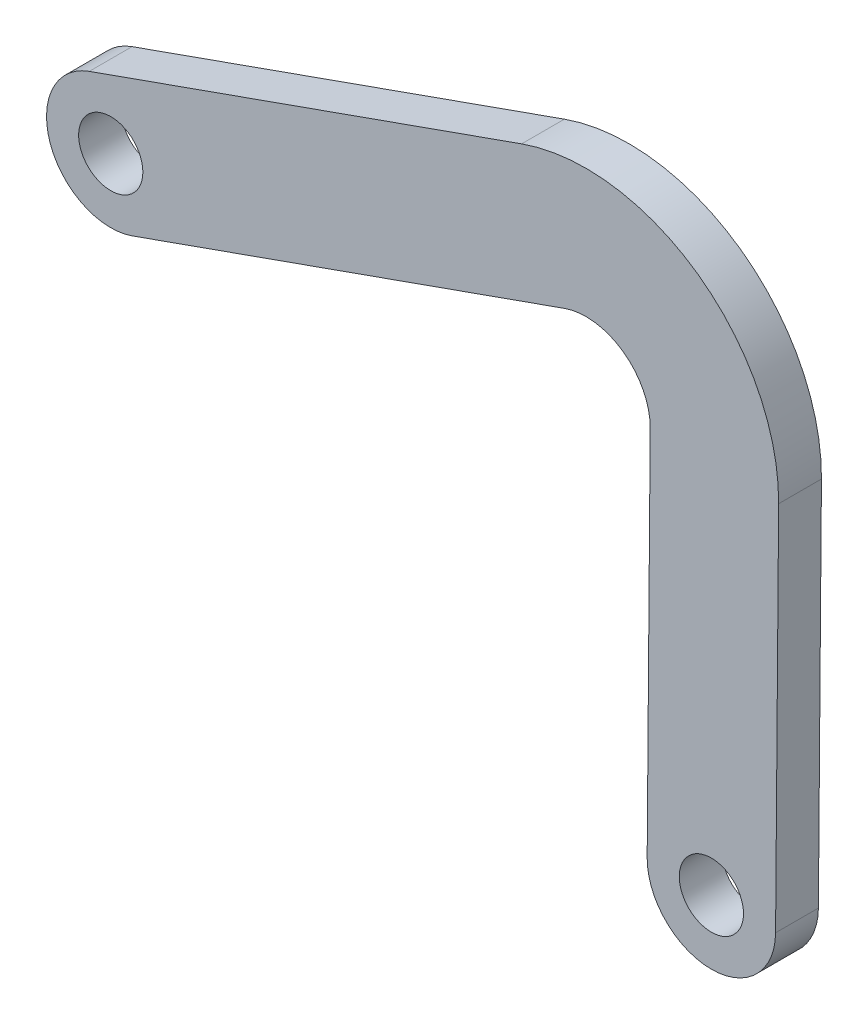
ISO-10303-21;
HEADER;
FILE_DESCRIPTION(('STEP AP214'),'2;1');
FILE_NAME('part.step','',(''),(''),'','','');
FILE_SCHEMA(('AUTOMOTIVE_DESIGN { 1 0 10303 214 1 1 1 1 }'));
ENDSEC;
DATA;
#1=APPLICATION_CONTEXT('core data for automotive mechanical design processes');
#2=APPLICATION_PROTOCOL_DEFINITION('international standard','automotive_design',2000,#1);
#3=PRODUCT_CONTEXT('',#1,'mechanical');
#4=PRODUCT('Part','Part','',(#3));
#5=PRODUCT_RELATED_PRODUCT_CATEGORY('part','',(#4));
#6=PRODUCT_DEFINITION_FORMATION('','',#4);
#7=PRODUCT_DEFINITION_CONTEXT('part definition',#1,'design');
#8=PRODUCT_DEFINITION('design','',#6,#7);
#9=PRODUCT_DEFINITION_SHAPE('','',#8);
#10=(LENGTH_UNIT() NAMED_UNIT(*) SI_UNIT(.MILLI.,.METRE.));
#11=(NAMED_UNIT(*) PLANE_ANGLE_UNIT() SI_UNIT($,.RADIAN.));
#12=(NAMED_UNIT(*) SI_UNIT($,.STERADIAN.) SOLID_ANGLE_UNIT());
#13=UNCERTAINTY_MEASURE_WITH_UNIT(LENGTH_MEASURE(1.E-05),#10,'distance_accuracy_value','');
#14=(GEOMETRIC_REPRESENTATION_CONTEXT(3) GLOBAL_UNCERTAINTY_ASSIGNED_CONTEXT((#13)) GLOBAL_UNIT_ASSIGNED_CONTEXT((#10,
#11,#12)) REPRESENTATION_CONTEXT('',''));
#15=CARTESIAN_POINT('',(0.,0.,0.));
#16=DIRECTION('',(0.,0.,1.));
#17=DIRECTION('',(1.,0.,0.));
#18=AXIS2_PLACEMENT_3D('',#15,#16,#17);
#19=CARTESIAN_POINT('',(7.48302305596481,-6.37749019733581,2.));
#20=DIRECTION('',(0.,0.,-1.));
#21=DIRECTION('',(-1.,0.,0.));
#22=AXIS2_PLACEMENT_3D('',#19,#20,#21);
#23=CYLINDRICAL_SURFACE('',#22,3.);
#24=CARTESIAN_POINT('',(7.48302305596481,-6.37749019733581,0.));
#25=DIRECTION('',(0.,0.,1.));
#26=DIRECTION('',(1.,0.,0.));
#27=AXIS2_PLACEMENT_3D('',#24,#25,#26);
#28=CIRCLE('',#27,3.);
#29=CARTESIAN_POINT('',(4.48312359016493,-6.35293016692821,0.));
#30=VERTEX_POINT('',#29);
#31=CARTESIAN_POINT('',(10.4829225217647,-6.4020502277434,0.));
#32=VERTEX_POINT('',#31);
#33=EDGE_CURVE('E129',#30,#32,#28,.T.);
#34=ORIENTED_EDGE('',*,*,#33,.T.);
#35=DIRECTION('',(0.,0.,-1.));
#36=VECTOR('',#35,1.);
#37=CARTESIAN_POINT('',(10.4829225217647,-6.4020502277434,2.));
#38=LINE('',#37,#36);
#39=CARTESIAN_POINT('',(10.4829225217647,-6.4020502277434,2.));
#40=VERTEX_POINT('',#39);
#41=EDGE_CURVE('E11',#40,#32,#38,.T.);
#42=ORIENTED_EDGE('',*,*,#41,.F.);
#43=CARTESIAN_POINT('',(7.48302305596481,-6.37749019733581,2.));
#44=DIRECTION('',(0.,0.,1.));
#45=DIRECTION('',(1.,0.,0.));
#46=AXIS2_PLACEMENT_3D('',#43,#44,#45);
#47=CIRCLE('',#46,3.);
#48=CARTESIAN_POINT('',(4.48312359016493,-6.35293016692821,2.));
#49=VERTEX_POINT('',#48);
#50=EDGE_CURVE('E144',#49,#40,#47,.T.);
#51=ORIENTED_EDGE('',*,*,#50,.F.);
#52=DIRECTION('',(0.,0.,-1.));
#53=VECTOR('',#52,1.);
#54=CARTESIAN_POINT('',(4.48312359016493,-6.35293016692821,2.));
#55=LINE('',#54,#53);
#56=EDGE_CURVE('E125',#49,#30,#55,.T.);
#57=ORIENTED_EDGE('',*,*,#56,.T.);
#58=EDGE_LOOP('',(#34,#42,#51,#57));
#59=FACE_BOUND('',#58,.T.);
#60=ADVANCED_FACE('F33',(#59),#23,.T.);
#61=CARTESIAN_POINT('',(10.6256325349473,11.0293488872389,2.));
#62=DIRECTION('',(-0.999966488599959,0.00818667680253175,0.));
#63=DIRECTION('',(-0.00818667680253175,-0.999966488599959,0.));
#64=AXIS2_PLACEMENT_3D('',#61,#62,#63);
#65=PLANE('',#64);
#66=DIRECTION('',(0.00818667680253174,0.999966488599958,0.));
#67=VECTOR('',#66,1.);
#68=CARTESIAN_POINT('',(10.6256325349473,11.0293488872389,0.));
#69=LINE('',#68,#67);
#70=CARTESIAN_POINT('',(10.6256325349473,11.0293488872389,0.));
#71=VERTEX_POINT('',#70);
#72=EDGE_CURVE('E132',#32,#71,#69,.T.);
#73=ORIENTED_EDGE('',*,*,#72,.T.);
#74=DIRECTION('',(0.,0.,-1.));
#75=VECTOR('',#74,1.);
#76=CARTESIAN_POINT('',(10.6256325349473,11.0293488872389,2.));
#77=LINE('',#76,#75);
#78=CARTESIAN_POINT('',(10.6256325349473,11.0293488872389,2.));
#79=VERTEX_POINT('',#78);
#80=EDGE_CURVE('E41',#79,#71,#77,.T.);
#81=ORIENTED_EDGE('',*,*,#80,.F.);
#82=DIRECTION('',(0.00818667680253174,0.999966488599958,0.));
#83=VECTOR('',#82,1.);
#84=CARTESIAN_POINT('',(10.6256325349473,11.0293488872389,2.));
#85=LINE('',#84,#83);
#86=EDGE_CURVE('E92',#40,#79,#85,.T.);
#87=ORIENTED_EDGE('',*,*,#86,.F.);
#88=ORIENTED_EDGE('',*,*,#41,.T.);
#89=EDGE_LOOP('',(#73,#81,#87,#88));
#90=FACE_BOUND('',#89,.T.);
#91=ADVANCED_FACE('F213',(#90),#65,.F.);
#92=CARTESIAN_POINT('',(1.62593413754769,11.1030289784617,2.));
#93=DIRECTION('',(0.,0.,-1.));
#94=DIRECTION('',(-1.,0.,0.));
#95=AXIS2_PLACEMENT_3D('',#92,#93,#94);
#96=CYLINDRICAL_SURFACE('',#95,9.00000000000001);
#97=CARTESIAN_POINT('',(1.62593413754769,11.1030289784617,0.));
#98=DIRECTION('',(0.,0.,1.));
#99=DIRECTION('',(1.,0.,0.));
#100=AXIS2_PLACEMENT_3D('',#97,#98,#99);
#101=CIRCLE('',#100,9.00000000000001);
#102=CARTESIAN_POINT('',(-1.38290736019787,19.5851792271571,0.));
#103=VERTEX_POINT('',#102);
#104=EDGE_CURVE('E135',#71,#103,#101,.T.);
#105=ORIENTED_EDGE('',*,*,#104,.T.);
#106=DIRECTION('',(0.,0.,-1.));
#107=VECTOR('',#106,1.);
#108=CARTESIAN_POINT('',(-1.38290736019787,19.5851792271571,2.));
#109=LINE('',#108,#107);
#110=CARTESIAN_POINT('',(-1.38290736019787,19.5851792271571,2.));
#111=VERTEX_POINT('',#110);
#112=EDGE_CURVE('E151',#111,#103,#109,.T.);
#113=ORIENTED_EDGE('',*,*,#112,.F.);
#114=CARTESIAN_POINT('',(1.62593413754769,11.1030289784617,2.));
#115=DIRECTION('',(0.,0.,1.));
#116=DIRECTION('',(1.,0.,0.));
#117=AXIS2_PLACEMENT_3D('',#114,#115,#116);
#118=CIRCLE('',#117,9.00000000000001);
#119=EDGE_CURVE('E159',#79,#111,#118,.T.);
#120=ORIENTED_EDGE('',*,*,#119,.F.);
#121=ORIENTED_EDGE('',*,*,#80,.T.);
#122=EDGE_LOOP('',(#105,#113,#120,#121));
#123=FACE_BOUND('',#122,.T.);
#124=ADVANCED_FACE('F157',(#123),#96,.T.);
#125=CARTESIAN_POINT('',(-21.5808975421416,12.4204215597441,2.));
#126=DIRECTION('',(0.334315721971729,-0.942461138743939,0.));
#127=DIRECTION('',(0.942461138743939,0.334315721971729,0.));
#128=AXIS2_PLACEMENT_3D('',#125,#126,#127);
#129=PLANE('',#128);
#130=DIRECTION('',(-0.942461138743938,-0.334315721971729,0.));
#131=VECTOR('',#130,1.);
#132=CARTESIAN_POINT('',(-21.5808975421416,12.4204215597441,0.));
#133=LINE('',#132,#131);
#134=CARTESIAN_POINT('',(-21.5808975421416,12.4204215597441,0.));
#135=VERTEX_POINT('',#134);
#136=EDGE_CURVE('E137',#103,#135,#133,.T.);
#137=ORIENTED_EDGE('',*,*,#136,.T.);
#138=DIRECTION('',(0.,0.,-1.));
#139=VECTOR('',#138,1.);
#140=CARTESIAN_POINT('',(-21.5808975421416,12.4204215597441,2.));
#141=LINE('',#140,#139);
#142=CARTESIAN_POINT('',(-21.5808975421416,12.4204215597441,2.));
#143=VERTEX_POINT('',#142);
#144=EDGE_CURVE('E148',#143,#135,#141,.T.);
#145=ORIENTED_EDGE('',*,*,#144,.F.);
#146=DIRECTION('',(-0.942461138743938,-0.334315721971729,0.));
#147=VECTOR('',#146,1.);
#148=CARTESIAN_POINT('',(-21.5808975421416,12.4204215597441,2.));
#149=LINE('',#148,#147);
#150=EDGE_CURVE('E171',#111,#143,#149,.T.);
#151=ORIENTED_EDGE('',*,*,#150,.F.);
#152=ORIENTED_EDGE('',*,*,#112,.T.);
#153=EDGE_LOOP('',(#137,#145,#151,#152));
#154=FACE_BOUND('',#153,.T.);
#155=ADVANCED_FACE('F167',(#154),#129,.F.);
#156=CARTESIAN_POINT('',(-20.5779503762265,9.59303814351232,2.));
#157=DIRECTION('',(0.,0.,-1.));
#158=DIRECTION('',(-1.,0.,0.));
#159=AXIS2_PLACEMENT_3D('',#156,#157,#158);
#160=CYLINDRICAL_SURFACE('',#159,3.);
#161=CARTESIAN_POINT('',(-20.5779503762265,9.59303814351232,0.));
#162=DIRECTION('',(0.,0.,1.));
#163=DIRECTION('',(-1.,0.,0.));
#164=AXIS2_PLACEMENT_3D('',#161,#162,#163);
#165=CIRCLE('',#164,3.);
#166=CARTESIAN_POINT('',(-19.5750032103113,6.7656547272805,0.));
#167=VERTEX_POINT('',#166);
#168=EDGE_CURVE('E139',#135,#167,#165,.T.);
#169=ORIENTED_EDGE('',*,*,#168,.T.);
#170=DIRECTION('',(0.,0.,-1.));
#171=VECTOR('',#170,1.);
#172=CARTESIAN_POINT('',(-19.5750032103113,6.7656547272805,2.));
#173=LINE('',#172,#171);
#174=CARTESIAN_POINT('',(-19.5750032103113,6.7656547272805,2.));
#175=VERTEX_POINT('',#174);
#176=EDGE_CURVE('E120',#175,#167,#173,.T.);
#177=ORIENTED_EDGE('',*,*,#176,.F.);
#178=CARTESIAN_POINT('',(-20.5779503762265,9.59303814351232,2.));
#179=DIRECTION('',(0.,0.,1.));
#180=DIRECTION('',(-1.,0.,0.));
#181=AXIS2_PLACEMENT_3D('',#178,#179,#180);
#182=CIRCLE('',#181,3.);
#183=EDGE_CURVE('E111',#143,#175,#182,.T.);
#184=ORIENTED_EDGE('',*,*,#183,.F.);
#185=ORIENTED_EDGE('',*,*,#144,.T.);
#186=EDGE_LOOP('',(#169,#177,#184,#185));
#187=FACE_BOUND('',#186,.T.);
#188=ADVANCED_FACE('F170',(#187),#160,.T.);
#189=CARTESIAN_POINT('',(-19.5750032103113,6.7656547272805,2.));
#190=DIRECTION('',(-0.334315721971729,0.942461138743939,0.));
#191=DIRECTION('',(-0.942461138743939,-0.334315721971729,0.));
#192=AXIS2_PLACEMENT_3D('',#189,#190,#191);
#193=PLANE('',#192);
#194=DIRECTION('',(0.942461138743939,0.334315721971729,0.));
#195=VECTOR('',#194,1.);
#196=CARTESIAN_POINT('',(-19.5750032103113,6.7656547272805,0.));
#197=LINE('',#196,#195);
#198=CARTESIAN_POINT('',(0.622986971632508,13.9304123946935,0.));
#199=VERTEX_POINT('',#198);
#200=EDGE_CURVE('E119',#167,#199,#197,.T.);
#201=ORIENTED_EDGE('',*,*,#200,.T.);
#202=DIRECTION('',(0.,0.,-1.));
#203=VECTOR('',#202,1.);
#204=CARTESIAN_POINT('',(0.622986971632508,13.9304123946935,2.));
#205=LINE('',#204,#203);
#206=CARTESIAN_POINT('',(0.622986971632508,13.9304123946935,2.));
#207=VERTEX_POINT('',#206);
#208=EDGE_CURVE('E116',#207,#199,#205,.T.);
#209=ORIENTED_EDGE('',*,*,#208,.F.);
#210=DIRECTION('',(0.942461138743939,0.334315721971729,0.));
#211=VECTOR('',#210,1.);
#212=CARTESIAN_POINT('',(-19.5750032103113,6.7656547272805,2.));
#213=LINE('',#212,#211);
#214=EDGE_CURVE('E105',#175,#207,#213,.T.);
#215=ORIENTED_EDGE('',*,*,#214,.F.);
#216=ORIENTED_EDGE('',*,*,#176,.T.);
#217=EDGE_LOOP('',(#201,#209,#215,#216));
#218=FACE_BOUND('',#217,.T.);
#219=ADVANCED_FACE('F117',(#218),#193,.F.);
#220=CARTESIAN_POINT('',(1.62593413754769,11.1030289784617,2.));
#221=DIRECTION('',(0.,0.,-1.));
#222=DIRECTION('',(-1.,0.,0.));
#223=AXIS2_PLACEMENT_3D('',#220,#221,#222);
#224=CYLINDRICAL_SURFACE('',#223,3.);
#225=CARTESIAN_POINT('',(1.62593413754769,11.1030289784617,0.));
#226=DIRECTION('',(0.,0.,-1.));
#227=DIRECTION('',(1.,0.,0.));
#228=AXIS2_PLACEMENT_3D('',#225,#226,#227);
#229=CIRCLE('',#228,3.);
#230=CARTESIAN_POINT('',(4.62583360334757,11.0784689480541,0.));
#231=VERTEX_POINT('',#230);
#232=EDGE_CURVE('E78',#199,#231,#229,.T.);
#233=ORIENTED_EDGE('',*,*,#232,.T.);
#234=DIRECTION('',(0.,0.,-1.));
#235=VECTOR('',#234,1.);
#236=CARTESIAN_POINT('',(4.62583360334757,11.0784689480541,2.));
#237=LINE('',#236,#235);
#238=CARTESIAN_POINT('',(4.62583360334757,11.0784689480541,2.));
#239=VERTEX_POINT('',#238);
#240=EDGE_CURVE('E121',#239,#231,#237,.T.);
#241=ORIENTED_EDGE('',*,*,#240,.F.);
#242=CARTESIAN_POINT('',(1.62593413754769,11.1030289784617,2.));
#243=DIRECTION('',(0.,0.,-1.));
#244=DIRECTION('',(1.,0.,0.));
#245=AXIS2_PLACEMENT_3D('',#242,#243,#244);
#246=CIRCLE('',#245,3.);
#247=EDGE_CURVE('E109',#207,#239,#246,.T.);
#248=ORIENTED_EDGE('',*,*,#247,.F.);
#249=ORIENTED_EDGE('',*,*,#208,.T.);
#250=EDGE_LOOP('',(#233,#241,#248,#249));
#251=FACE_BOUND('',#250,.T.);
#252=ADVANCED_FACE('F123',(#251),#224,.F.);
#253=CARTESIAN_POINT('',(4.48312359016493,-6.35293016692821,2.));
#254=DIRECTION('',(0.999966488599959,-0.0081866768025318,0.));
#255=DIRECTION('',(0.0081866768025318,0.999966488599959,0.));
#256=AXIS2_PLACEMENT_3D('',#253,#254,#255);
#257=PLANE('',#256);
#258=DIRECTION('',(-0.00818667680253179,-0.999966488599958,0.));
#259=VECTOR('',#258,1.);
#260=CARTESIAN_POINT('',(4.48312359016493,-6.35293016692821,0.));
#261=LINE('',#260,#259);
#262=EDGE_CURVE('E84',#231,#30,#261,.T.);
#263=ORIENTED_EDGE('',*,*,#262,.T.);
#264=ORIENTED_EDGE('',*,*,#56,.F.);
#265=DIRECTION('',(-0.00818667680253179,-0.999966488599958,0.));
#266=VECTOR('',#265,1.);
#267=CARTESIAN_POINT('',(4.48312359016493,-6.35293016692821,2.));
#268=LINE('',#267,#266);
#269=EDGE_CURVE('E49',#239,#49,#268,.T.);
#270=ORIENTED_EDGE('',*,*,#269,.F.);
#271=ORIENTED_EDGE('',*,*,#240,.T.);
#272=EDGE_LOOP('',(#263,#264,#270,#271));
#273=FACE_BOUND('',#272,.T.);
#274=ADVANCED_FACE('F200',(#273),#257,.F.);
#275=CARTESIAN_POINT('',(7.48302305596481,-6.37749019733581,2.));
#276=DIRECTION('',(0.,0.,1.));
#277=DIRECTION('',(1.,0.,0.));
#278=AXIS2_PLACEMENT_3D('',#275,#276,#277);
#279=PLANE('',#278);
#280=CARTESIAN_POINT('',(7.48302305596481,-6.37749019733581,2.));
#281=DIRECTION('',(0.,0.,1.));
#282=DIRECTION('',(1.,0.,0.));
#283=AXIS2_PLACEMENT_3D('',#280,#281,#282);
#284=CIRCLE('',#283,1.5);
#285=CARTESIAN_POINT('',(8.98302305596481,-6.37749019733581,2.));
#286=VERTEX_POINT('',#285);
#287=EDGE_CURVE('E183',#286,#286,#284,.T.);
#288=ORIENTED_EDGE('',*,*,#287,.F.);
#289=EDGE_LOOP('',(#288));
#290=FACE_BOUND('',#289,.T.);
#291=CARTESIAN_POINT('',(-20.5779503762265,9.59303814351232,2.));
#292=DIRECTION('',(0.,0.,1.));
#293=DIRECTION('',(1.,0.,0.));
#294=AXIS2_PLACEMENT_3D('',#291,#292,#293);
#295=CIRCLE('',#294,1.5);
#296=CARTESIAN_POINT('',(-19.0779503762265,9.59303814351232,2.));
#297=VERTEX_POINT('',#296);
#298=EDGE_CURVE('E177',#297,#297,#295,.T.);
#299=ORIENTED_EDGE('',*,*,#298,.F.);
#300=EDGE_LOOP('',(#299));
#301=FACE_BOUND('',#300,.T.);
#302=ORIENTED_EDGE('',*,*,#50,.T.);
#303=ORIENTED_EDGE('',*,*,#86,.T.);
#304=ORIENTED_EDGE('',*,*,#119,.T.);
#305=ORIENTED_EDGE('',*,*,#150,.T.);
#306=ORIENTED_EDGE('',*,*,#183,.T.);
#307=ORIENTED_EDGE('',*,*,#214,.T.);
#308=ORIENTED_EDGE('',*,*,#247,.T.);
#309=ORIENTED_EDGE('',*,*,#269,.T.);
#310=EDGE_LOOP('',(#302,#303,#304,#305,#306,#307,#308,#309));
#311=FACE_BOUND('',#310,.T.);
#312=ADVANCED_FACE('F107',(#290,#301,#311),#279,.T.);
#313=CARTESIAN_POINT('',(7.48302305596481,-6.37749019733581,0.));
#314=DIRECTION('',(0.,0.,1.));
#315=DIRECTION('',(1.,0.,0.));
#316=AXIS2_PLACEMENT_3D('',#313,#314,#315);
#317=PLANE('',#316);
#318=CARTESIAN_POINT('',(7.48302305596481,-6.37749019733581,0.));
#319=DIRECTION('',(0.,0.,1.));
#320=DIRECTION('',(1.,0.,0.));
#321=AXIS2_PLACEMENT_3D('',#318,#319,#320);
#322=CIRCLE('',#321,1.5);
#323=CARTESIAN_POINT('',(8.98302305596481,-6.37749019733581,0.));
#324=VERTEX_POINT('',#323);
#325=EDGE_CURVE('E133',#324,#324,#322,.T.);
#326=ORIENTED_EDGE('',*,*,#325,.T.);
#327=EDGE_LOOP('',(#326));
#328=FACE_BOUND('',#327,.T.);
#329=CARTESIAN_POINT('',(-20.5779503762265,9.59303814351232,0.));
#330=DIRECTION('',(0.,0.,1.));
#331=DIRECTION('',(1.,0.,0.));
#332=AXIS2_PLACEMENT_3D('',#329,#330,#331);
#333=CIRCLE('',#332,1.5);
#334=CARTESIAN_POINT('',(-19.0779503762265,9.59303814351232,0.));
#335=VERTEX_POINT('',#334);
#336=EDGE_CURVE('E180',#335,#335,#333,.T.);
#337=ORIENTED_EDGE('',*,*,#336,.T.);
#338=EDGE_LOOP('',(#337));
#339=FACE_BOUND('',#338,.T.);
#340=ORIENTED_EDGE('',*,*,#33,.F.);
#341=ORIENTED_EDGE('',*,*,#262,.F.);
#342=ORIENTED_EDGE('',*,*,#232,.F.);
#343=ORIENTED_EDGE('',*,*,#200,.F.);
#344=ORIENTED_EDGE('',*,*,#168,.F.);
#345=ORIENTED_EDGE('',*,*,#136,.F.);
#346=ORIENTED_EDGE('',*,*,#104,.F.);
#347=ORIENTED_EDGE('',*,*,#72,.F.);
#348=EDGE_LOOP('',(#340,#341,#342,#343,#344,#345,#346,#347));
#349=FACE_BOUND('',#348,.T.);
#350=ADVANCED_FACE('F163',(#328,#339,#349),#317,.F.);
#351=CARTESIAN_POINT('',(-20.5779503762265,9.59303814351232,0.));
#352=DIRECTION('',(0.,0.,1.));
#353=DIRECTION('',(1.,0.,0.));
#354=AXIS2_PLACEMENT_3D('',#351,#352,#353);
#355=CYLINDRICAL_SURFACE('',#354,1.5);
#356=ORIENTED_EDGE('',*,*,#336,.F.);
#357=EDGE_LOOP('',(#356));
#358=FACE_BOUND('',#357,.T.);
#359=ORIENTED_EDGE('',*,*,#298,.T.);
#360=EDGE_LOOP('',(#359));
#361=FACE_BOUND('',#360,.T.);
#362=ADVANCED_FACE('F194',(#358,#361),#355,.F.);
#363=CARTESIAN_POINT('',(7.48302305596481,-6.37749019733581,0.));
#364=DIRECTION('',(0.,0.,1.));
#365=DIRECTION('',(1.,0.,0.));
#366=AXIS2_PLACEMENT_3D('',#363,#364,#365);
#367=CYLINDRICAL_SURFACE('',#366,1.5);
#368=ORIENTED_EDGE('',*,*,#325,.F.);
#369=EDGE_LOOP('',(#368));
#370=FACE_BOUND('',#369,.T.);
#371=ORIENTED_EDGE('',*,*,#287,.T.);
#372=EDGE_LOOP('',(#371));
#373=FACE_BOUND('',#372,.T.);
#374=ADVANCED_FACE('F191',(#370,#373),#367,.F.);
#375=CLOSED_SHELL('',(#60,#91,#124,#155,#188,#219,#252,#274,#312,#350,#362,#374));
#376=MANIFOLD_SOLID_BREP('B2',#375);
#377=ADVANCED_BREP_SHAPE_REPRESENTATION('',(#18,#376),#14);
#378=SHAPE_DEFINITION_REPRESENTATION(#9,#377);
ENDSEC;
END-ISO-10303-21;
